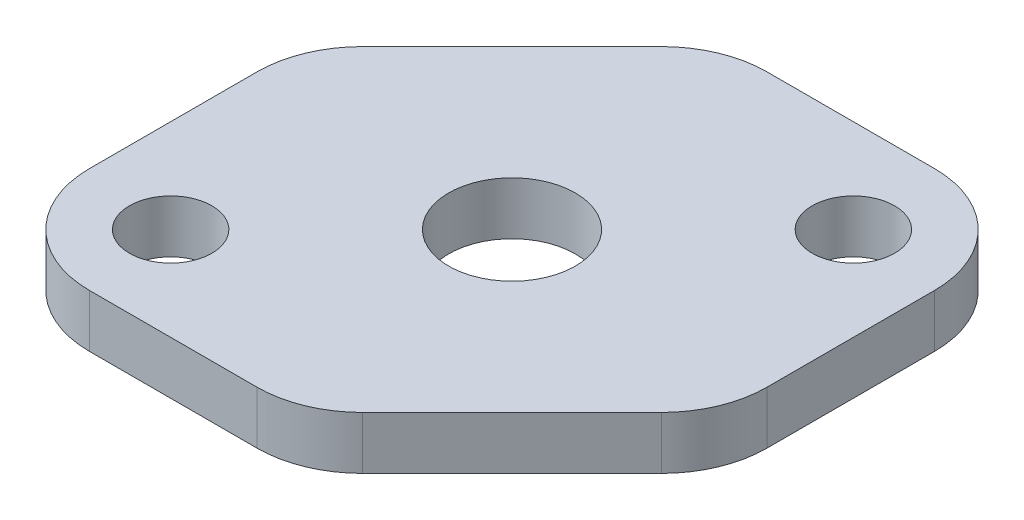
ISO-10303-21;
HEADER;
FILE_DESCRIPTION(('STEP AP214'),'2;1');
FILE_NAME('part.step','',(''),(''),'','','');
FILE_SCHEMA(('AUTOMOTIVE_DESIGN { 1 0 10303 214 1 1 1 1 }'));
ENDSEC;
DATA;
#1=APPLICATION_CONTEXT('core data for automotive mechanical design processes');
#2=APPLICATION_PROTOCOL_DEFINITION('international standard','automotive_design',2000,#1);
#3=PRODUCT_CONTEXT('',#1,'mechanical');
#4=PRODUCT('Part','Part','',(#3));
#5=PRODUCT_RELATED_PRODUCT_CATEGORY('part','',(#4));
#6=PRODUCT_DEFINITION_FORMATION('','',#4);
#7=PRODUCT_DEFINITION_CONTEXT('part definition',#1,'design');
#8=PRODUCT_DEFINITION('design','',#6,#7);
#9=PRODUCT_DEFINITION_SHAPE('','',#8);
#10=(LENGTH_UNIT() NAMED_UNIT(*) SI_UNIT(.MILLI.,.METRE.));
#11=(NAMED_UNIT(*) PLANE_ANGLE_UNIT() SI_UNIT($,.RADIAN.));
#12=(NAMED_UNIT(*) SI_UNIT($,.STERADIAN.) SOLID_ANGLE_UNIT());
#13=UNCERTAINTY_MEASURE_WITH_UNIT(LENGTH_MEASURE(1.E-05),#10,'distance_accuracy_value','');
#14=(GEOMETRIC_REPRESENTATION_CONTEXT(3) GLOBAL_UNCERTAINTY_ASSIGNED_CONTEXT((#13)) GLOBAL_UNIT_ASSIGNED_CONTEXT((#10,
#11,#12)) REPRESENTATION_CONTEXT('',''));
#15=CARTESIAN_POINT('',(0.,0.,0.));
#16=DIRECTION('',(0.,0.,1.));
#17=DIRECTION('',(1.,0.,0.));
#18=AXIS2_PLACEMENT_3D('',#15,#16,#17);
#19=CARTESIAN_POINT('',(15.875,3.175,15.875));
#20=DIRECTION('',(-1.,0.,0.));
#21=DIRECTION('',(0.,0.,1.));
#22=AXIS2_PLACEMENT_3D('',#19,#20,#21);
#23=PLANE('',#22);
#24=DIRECTION('',(0.,0.,-1.));
#25=VECTOR('',#24,1.);
#26=CARTESIAN_POINT('',(15.875,0.,15.875));
#27=LINE('',#26,#25);
#28=CARTESIAN_POINT('',(15.875,0.,0.544743878930843));
#29=VERTEX_POINT('',#28);
#30=CARTESIAN_POINT('',(15.875,0.,-9.525));
#31=VERTEX_POINT('',#30);
#32=EDGE_CURVE('E159',#29,#31,#27,.T.);
#33=ORIENTED_EDGE('',*,*,#32,.T.);
#34=DIRECTION('',(0.,-1.,0.));
#35=VECTOR('',#34,1.);
#36=CARTESIAN_POINT('',(15.875,3.175,-9.525));
#37=LINE('',#36,#35);
#38=CARTESIAN_POINT('',(15.875,3.175,-9.525));
#39=VERTEX_POINT('',#38);
#40=EDGE_CURVE('E132',#31,#39,#37,.F.);
#41=ORIENTED_EDGE('',*,*,#40,.T.);
#42=DIRECTION('',(0.,0.,-1.));
#43=VECTOR('',#42,1.);
#44=CARTESIAN_POINT('',(15.875,3.175,15.875));
#45=LINE('',#44,#43);
#46=CARTESIAN_POINT('',(15.875,3.175,0.544743878930843));
#47=VERTEX_POINT('',#46);
#48=EDGE_CURVE('E171',#47,#39,#45,.T.);
#49=ORIENTED_EDGE('',*,*,#48,.F.);
#50=DIRECTION('',(0.,1.,0.));
#51=VECTOR('',#50,1.);
#52=CARTESIAN_POINT('',(15.875,3.175,0.544743878930843));
#53=LINE('',#52,#51);
#54=EDGE_CURVE('E212',#47,#29,#53,.F.);
#55=ORIENTED_EDGE('',*,*,#54,.T.);
#56=EDGE_LOOP('',(#33,#41,#49,#55));
#57=FACE_BOUND('',#56,.T.);
#58=ADVANCED_FACE('F38',(#57),#23,.F.);
#59=CARTESIAN_POINT('',(-15.875,3.175,-15.875));
#60=DIRECTION('',(0.,0.,1.));
#61=DIRECTION('',(1.,0.,0.));
#62=AXIS2_PLACEMENT_3D('',#59,#60,#61);
#63=PLANE('',#62);
#64=DIRECTION('',(-1.,0.,0.));
#65=VECTOR('',#64,1.);
#66=CARTESIAN_POINT('',(-15.875,0.,-15.875));
#67=LINE('',#66,#65);
#68=CARTESIAN_POINT('',(9.52500000000001,0.,-15.875));
#69=VERTEX_POINT('',#68);
#70=CARTESIAN_POINT('',(-0.544743878930838,0.,-15.875));
#71=VERTEX_POINT('',#70);
#72=EDGE_CURVE('E145',#69,#71,#67,.T.);
#73=ORIENTED_EDGE('',*,*,#72,.T.);
#74=DIRECTION('',(0.,1.,0.));
#75=VECTOR('',#74,1.);
#76=CARTESIAN_POINT('',(-0.544743878930838,3.175,-15.875));
#77=LINE('',#76,#75);
#78=CARTESIAN_POINT('',(-0.544743878930838,3.175,-15.875));
#79=VERTEX_POINT('',#78);
#80=EDGE_CURVE('E150',#71,#79,#77,.T.);
#81=ORIENTED_EDGE('',*,*,#80,.T.);
#82=DIRECTION('',(-1.,0.,0.));
#83=VECTOR('',#82,1.);
#84=CARTESIAN_POINT('',(-15.875,3.175,-15.875));
#85=LINE('',#84,#83);
#86=CARTESIAN_POINT('',(9.52500000000001,3.175,-15.875));
#87=VERTEX_POINT('',#86);
#88=EDGE_CURVE('E148',#87,#79,#85,.T.);
#89=ORIENTED_EDGE('',*,*,#88,.F.);
#90=DIRECTION('',(0.,-1.,0.));
#91=VECTOR('',#90,1.);
#92=CARTESIAN_POINT('',(9.52500000000001,3.175,-15.875));
#93=LINE('',#92,#91);
#94=EDGE_CURVE('E131',#87,#69,#93,.T.);
#95=ORIENTED_EDGE('',*,*,#94,.T.);
#96=EDGE_LOOP('',(#73,#81,#89,#95));
#97=FACE_BOUND('',#96,.T.);
#98=ADVANCED_FACE('F143',(#97),#63,.F.);
#99=CARTESIAN_POINT('',(-15.875,3.175,15.875));
#100=DIRECTION('',(1.,0.,0.));
#101=DIRECTION('',(0.,0.,-1.));
#102=AXIS2_PLACEMENT_3D('',#99,#100,#101);
#103=PLANE('',#102);
#104=DIRECTION('',(0.,0.,1.));
#105=VECTOR('',#104,1.);
#106=CARTESIAN_POINT('',(-15.875,0.,15.875));
#107=LINE('',#106,#105);
#108=CARTESIAN_POINT('',(-15.875,0.,-0.544743878930849));
#109=VERTEX_POINT('',#108);
#110=CARTESIAN_POINT('',(-15.875,0.,9.525));
#111=VERTEX_POINT('',#110);
#112=EDGE_CURVE('E158',#109,#111,#107,.T.);
#113=ORIENTED_EDGE('',*,*,#112,.T.);
#114=DIRECTION('',(0.,-1.,0.));
#115=VECTOR('',#114,1.);
#116=CARTESIAN_POINT('',(-15.875,3.175,9.525));
#117=LINE('',#116,#115);
#118=CARTESIAN_POINT('',(-15.875,3.175,9.525));
#119=VERTEX_POINT('',#118);
#120=EDGE_CURVE('E11',#111,#119,#117,.F.);
#121=ORIENTED_EDGE('',*,*,#120,.T.);
#122=DIRECTION('',(0.,0.,1.));
#123=VECTOR('',#122,1.);
#124=CARTESIAN_POINT('',(-15.875,3.175,15.875));
#125=LINE('',#124,#123);
#126=CARTESIAN_POINT('',(-15.875,3.175,-0.544743878930849));
#127=VERTEX_POINT('',#126);
#128=EDGE_CURVE('E235',#127,#119,#125,.T.);
#129=ORIENTED_EDGE('',*,*,#128,.F.);
#130=DIRECTION('',(0.,1.,0.));
#131=VECTOR('',#130,1.);
#132=CARTESIAN_POINT('',(-15.875,3.175,-0.544743878930849));
#133=LINE('',#132,#131);
#134=EDGE_CURVE('E47',#127,#109,#133,.F.);
#135=ORIENTED_EDGE('',*,*,#134,.T.);
#136=EDGE_LOOP('',(#113,#121,#129,#135));
#137=FACE_BOUND('',#136,.T.);
#138=ADVANCED_FACE('F295',(#137),#103,.F.);
#139=CARTESIAN_POINT('',(-15.875,3.175,15.875));
#140=DIRECTION('',(0.,0.,-1.));
#141=DIRECTION('',(-1.,0.,0.));
#142=AXIS2_PLACEMENT_3D('',#139,#140,#141);
#143=PLANE('',#142);
#144=DIRECTION('',(1.,0.,0.));
#145=VECTOR('',#144,1.);
#146=CARTESIAN_POINT('',(-15.875,0.,15.875));
#147=LINE('',#146,#145);
#148=CARTESIAN_POINT('',(-9.52499999999999,0.,15.875));
#149=VERTEX_POINT('',#148);
#150=CARTESIAN_POINT('',(0.544743878930856,0.,15.875));
#151=VERTEX_POINT('',#150);
#152=EDGE_CURVE('E163',#149,#151,#147,.T.);
#153=ORIENTED_EDGE('',*,*,#152,.T.);
#154=DIRECTION('',(0.,1.,0.));
#155=VECTOR('',#154,1.);
#156=CARTESIAN_POINT('',(0.544743878930856,3.175,15.875));
#157=LINE('',#156,#155);
#158=CARTESIAN_POINT('',(0.544743878930856,3.175,15.875));
#159=VERTEX_POINT('',#158);
#160=EDGE_CURVE('E228',#151,#159,#157,.T.);
#161=ORIENTED_EDGE('',*,*,#160,.T.);
#162=DIRECTION('',(1.,0.,0.));
#163=VECTOR('',#162,1.);
#164=CARTESIAN_POINT('',(-15.875,3.175,15.875));
#165=LINE('',#164,#163);
#166=CARTESIAN_POINT('',(-9.52499999999999,3.175,15.875));
#167=VERTEX_POINT('',#166);
#168=EDGE_CURVE('E151',#167,#159,#165,.T.);
#169=ORIENTED_EDGE('',*,*,#168,.F.);
#170=DIRECTION('',(0.,-1.,0.));
#171=VECTOR('',#170,1.);
#172=CARTESIAN_POINT('',(-9.52499999999999,3.175,15.875));
#173=LINE('',#172,#171);
#174=EDGE_CURVE('E224',#167,#149,#173,.T.);
#175=ORIENTED_EDGE('',*,*,#174,.T.);
#176=EDGE_LOOP('',(#153,#161,#169,#175));
#177=FACE_BOUND('',#176,.T.);
#178=ADVANCED_FACE('F302',(#177),#143,.F.);
#179=CARTESIAN_POINT('',(0.,3.175,0.));
#180=DIRECTION('',(0.,-1.,0.));
#181=DIRECTION('',(0.,0.,-1.));
#182=AXIS2_PLACEMENT_3D('',#179,#180,#181);
#183=PLANE('',#182);
#184=CARTESIAN_POINT('',(0.,3.175,0.));
#185=DIRECTION('',(0.,-1.,0.));
#186=DIRECTION('',(0.,0.,-1.));
#187=AXIS2_PLACEMENT_3D('',#184,#185,#186);
#188=CIRCLE('',#187,3.81);
#189=CARTESIAN_POINT('',(0.,3.175,-3.81));
#190=VERTEX_POINT('',#189);
#191=EDGE_CURVE('E251',#190,#190,#188,.T.);
#192=ORIENTED_EDGE('',*,*,#191,.T.);
#193=EDGE_LOOP('',(#192));
#194=FACE_BOUND('',#193,.T.);
#195=CARTESIAN_POINT('',(-10.2623399243318,3.175,10.2623399243318));
#196=DIRECTION('',(0.,-1.,0.));
#197=DIRECTION('',(0.,0.,-1.));
#198=AXIS2_PLACEMENT_3D('',#195,#196,#197);
#199=CIRCLE('',#198,2.4765);
#200=CARTESIAN_POINT('',(-10.2623399243318,3.175,7.78583992433178));
#201=VERTEX_POINT('',#200);
#202=EDGE_CURVE('E165',#201,#201,#199,.T.);
#203=ORIENTED_EDGE('',*,*,#202,.T.);
#204=EDGE_LOOP('',(#203));
#205=FACE_BOUND('',#204,.T.);
#206=CARTESIAN_POINT('',(10.2623399243318,3.175,-10.2623399243318));
#207=DIRECTION('',(0.,-1.,0.));
#208=DIRECTION('',(0.,0.,-1.));
#209=AXIS2_PLACEMENT_3D('',#206,#207,#208);
#210=CIRCLE('',#209,2.4765);
#211=CARTESIAN_POINT('',(10.2623399243318,3.175,-12.7388399243318));
#212=VERTEX_POINT('',#211);
#213=EDGE_CURVE('E250',#212,#212,#210,.T.);
#214=ORIENTED_EDGE('',*,*,#213,.T.);
#215=EDGE_LOOP('',(#214));
#216=FACE_BOUND('',#215,.T.);
#217=ORIENTED_EDGE('',*,*,#88,.T.);
#218=CARTESIAN_POINT('',(-0.544743878930838,3.175,-9.525));
#219=DIRECTION('',(0.,-1.,0.));
#220=DIRECTION('',(0.,0.,-1.));
#221=AXIS2_PLACEMENT_3D('',#218,#219,#220);
#222=CIRCLE('',#221,6.35);
#223=CARTESIAN_POINT('',(-5.03487193946541,3.175,-14.0151280605346));
#224=VERTEX_POINT('',#223);
#225=EDGE_CURVE('E190',#79,#224,#222,.F.);
#226=ORIENTED_EDGE('',*,*,#225,.T.);
#227=DIRECTION('',(0.707106781186547,0.,-0.707106781186547));
#228=VECTOR('',#227,1.);
#229=CARTESIAN_POINT('',(-3.17499999999999,3.175,-15.875));
#230=LINE('',#229,#228);
#231=CARTESIAN_POINT('',(-14.0151280605346,3.175,-5.03487193946543));
#232=VERTEX_POINT('',#231);
#233=EDGE_CURVE('E278',#232,#224,#230,.T.);
#234=ORIENTED_EDGE('',*,*,#233,.F.);
#235=CARTESIAN_POINT('',(-9.52499999999999,3.175,-0.54474387893085));
#236=DIRECTION('',(0.,-1.,0.));
#237=DIRECTION('',(0.,0.,-1.));
#238=AXIS2_PLACEMENT_3D('',#235,#236,#237);
#239=CIRCLE('',#238,6.35);
#240=EDGE_CURVE('E175',#232,#127,#239,.F.);
#241=ORIENTED_EDGE('',*,*,#240,.T.);
#242=ORIENTED_EDGE('',*,*,#128,.T.);
#243=CARTESIAN_POINT('',(-9.52499999999999,3.175,9.525));
#244=DIRECTION('',(0.,-1.,0.));
#245=DIRECTION('',(0.,0.,-1.));
#246=AXIS2_PLACEMENT_3D('',#243,#244,#245);
#247=CIRCLE('',#246,6.35);
#248=EDGE_CURVE('E178',#119,#167,#247,.F.);
#249=ORIENTED_EDGE('',*,*,#248,.T.);
#250=ORIENTED_EDGE('',*,*,#168,.T.);
#251=CARTESIAN_POINT('',(0.544743878930856,3.175,9.525));
#252=DIRECTION('',(0.,-1.,0.));
#253=DIRECTION('',(0.,0.,-1.));
#254=AXIS2_PLACEMENT_3D('',#251,#252,#253);
#255=CIRCLE('',#254,6.35);
#256=CARTESIAN_POINT('',(5.03487193946543,3.175,14.0151280605346));
#257=VERTEX_POINT('',#256);
#258=EDGE_CURVE('E181',#159,#257,#255,.F.);
#259=ORIENTED_EDGE('',*,*,#258,.T.);
#260=DIRECTION('',(-0.707106781186547,0.,0.707106781186547));
#261=VECTOR('',#260,1.);
#262=CARTESIAN_POINT('',(15.875,3.175,3.175));
#263=LINE('',#262,#261);
#264=CARTESIAN_POINT('',(14.0151280605346,3.175,5.03487193946542));
#265=VERTEX_POINT('',#264);
#266=EDGE_CURVE('E270',#265,#257,#263,.T.);
#267=ORIENTED_EDGE('',*,*,#266,.F.);
#268=CARTESIAN_POINT('',(9.52500000000001,3.175,0.544743878930843));
#269=DIRECTION('',(0.,-1.,0.));
#270=DIRECTION('',(0.,0.,-1.));
#271=AXIS2_PLACEMENT_3D('',#268,#269,#270);
#272=CIRCLE('',#271,6.35);
#273=EDGE_CURVE('E184',#265,#47,#272,.F.);
#274=ORIENTED_EDGE('',*,*,#273,.T.);
#275=ORIENTED_EDGE('',*,*,#48,.T.);
#276=CARTESIAN_POINT('',(9.52500000000001,3.175,-9.525));
#277=DIRECTION('',(0.,-1.,0.));
#278=DIRECTION('',(0.,0.,-1.));
#279=AXIS2_PLACEMENT_3D('',#276,#277,#278);
#280=CIRCLE('',#279,6.35);
#281=EDGE_CURVE('E187',#39,#87,#280,.F.);
#282=ORIENTED_EDGE('',*,*,#281,.T.);
#283=EDGE_LOOP('',(#217,#226,#234,#241,#242,#249,#250,#259,#267,#274,#275,#282));
#284=FACE_BOUND('',#283,.T.);
#285=ADVANCED_FACE('F290',(#194,#205,#216,#284),#183,.F.);
#286=CARTESIAN_POINT('',(0.,0.,0.));
#287=DIRECTION('',(0.,-1.,0.));
#288=DIRECTION('',(0.,0.,-1.));
#289=AXIS2_PLACEMENT_3D('',#286,#287,#288);
#290=PLANE('',#289);
#291=DIRECTION('',(0.707106781186547,0.,-0.707106781186547));
#292=VECTOR('',#291,1.);
#293=CARTESIAN_POINT('',(-3.17499999999999,0.,-15.875));
#294=LINE('',#293,#292);
#295=CARTESIAN_POINT('',(-14.0151280605346,0.,-5.03487193946543));
#296=VERTEX_POINT('',#295);
#297=CARTESIAN_POINT('',(-5.03487193946541,0.,-14.0151280605346));
#298=VERTEX_POINT('',#297);
#299=EDGE_CURVE('E266',#296,#298,#294,.T.);
#300=ORIENTED_EDGE('',*,*,#299,.T.);
#301=CARTESIAN_POINT('',(-0.544743878930838,0.,-9.525));
#302=DIRECTION('',(0.,-1.,0.));
#303=DIRECTION('',(0.,0.,-1.));
#304=AXIS2_PLACEMENT_3D('',#301,#302,#303);
#305=CIRCLE('',#304,6.35);
#306=EDGE_CURVE('E137',#298,#71,#305,.T.);
#307=ORIENTED_EDGE('',*,*,#306,.T.);
#308=ORIENTED_EDGE('',*,*,#72,.F.);
#309=CARTESIAN_POINT('',(9.52500000000001,0.,-9.525));
#310=DIRECTION('',(0.,-1.,0.));
#311=DIRECTION('',(0.,0.,-1.));
#312=AXIS2_PLACEMENT_3D('',#309,#310,#311);
#313=CIRCLE('',#312,6.35);
#314=EDGE_CURVE('E127',#69,#31,#313,.T.);
#315=ORIENTED_EDGE('',*,*,#314,.T.);
#316=ORIENTED_EDGE('',*,*,#32,.F.);
#317=CARTESIAN_POINT('',(9.52500000000001,0.,0.544743878930843));
#318=DIRECTION('',(0.,-1.,0.));
#319=DIRECTION('',(0.,0.,-1.));
#320=AXIS2_PLACEMENT_3D('',#317,#318,#319);
#321=CIRCLE('',#320,6.35);
#322=CARTESIAN_POINT('',(14.0151280605346,0.,5.03487193946542));
#323=VERTEX_POINT('',#322);
#324=EDGE_CURVE('E138',#29,#323,#321,.T.);
#325=ORIENTED_EDGE('',*,*,#324,.T.);
#326=DIRECTION('',(-0.707106781186547,0.,0.707106781186547));
#327=VECTOR('',#326,1.);
#328=CARTESIAN_POINT('',(15.875,0.,3.175));
#329=LINE('',#328,#327);
#330=CARTESIAN_POINT('',(5.03487193946543,0.,14.0151280605346));
#331=VERTEX_POINT('',#330);
#332=EDGE_CURVE('E274',#323,#331,#329,.T.);
#333=ORIENTED_EDGE('',*,*,#332,.T.);
#334=CARTESIAN_POINT('',(0.544743878930856,0.,9.525));
#335=DIRECTION('',(0.,-1.,0.));
#336=DIRECTION('',(0.,0.,-1.));
#337=AXIS2_PLACEMENT_3D('',#334,#335,#336);
#338=CIRCLE('',#337,6.35);
#339=EDGE_CURVE('E205',#331,#151,#338,.T.);
#340=ORIENTED_EDGE('',*,*,#339,.T.);
#341=ORIENTED_EDGE('',*,*,#152,.F.);
#342=CARTESIAN_POINT('',(-9.52499999999999,0.,9.525));
#343=DIRECTION('',(0.,-1.,0.));
#344=DIRECTION('',(0.,0.,-1.));
#345=AXIS2_PLACEMENT_3D('',#342,#343,#344);
#346=CIRCLE('',#345,6.35);
#347=EDGE_CURVE('E54',#149,#111,#346,.T.);
#348=ORIENTED_EDGE('',*,*,#347,.T.);
#349=ORIENTED_EDGE('',*,*,#112,.F.);
#350=CARTESIAN_POINT('',(-9.52499999999999,0.,-0.54474387893085));
#351=DIRECTION('',(0.,-1.,0.));
#352=DIRECTION('',(0.,0.,-1.));
#353=AXIS2_PLACEMENT_3D('',#350,#351,#352);
#354=CIRCLE('',#353,6.35);
#355=EDGE_CURVE('E200',#109,#296,#354,.T.);
#356=ORIENTED_EDGE('',*,*,#355,.T.);
#357=EDGE_LOOP('',(#300,#307,#308,#315,#316,#325,#333,#340,#341,#348,#349,#356));
#358=FACE_BOUND('',#357,.T.);
#359=CARTESIAN_POINT('',(0.,0.,0.));
#360=DIRECTION('',(0.,-1.,0.));
#361=DIRECTION('',(0.,0.,-1.));
#362=AXIS2_PLACEMENT_3D('',#359,#360,#361);
#363=CIRCLE('',#362,3.81);
#364=CARTESIAN_POINT('',(0.,0.,-3.81));
#365=VERTEX_POINT('',#364);
#366=EDGE_CURVE('E262',#365,#365,#363,.T.);
#367=ORIENTED_EDGE('',*,*,#366,.F.);
#368=EDGE_LOOP('',(#367));
#369=FACE_BOUND('',#368,.T.);
#370=CARTESIAN_POINT('',(-10.2623399243318,0.,10.2623399243318));
#371=DIRECTION('',(0.,-1.,0.));
#372=DIRECTION('',(0.,0.,-1.));
#373=AXIS2_PLACEMENT_3D('',#370,#371,#372);
#374=CIRCLE('',#373,2.4765);
#375=CARTESIAN_POINT('',(-10.2623399243318,0.,7.78583992433178));
#376=VERTEX_POINT('',#375);
#377=EDGE_CURVE('E255',#376,#376,#374,.T.);
#378=ORIENTED_EDGE('',*,*,#377,.F.);
#379=EDGE_LOOP('',(#378));
#380=FACE_BOUND('',#379,.T.);
#381=CARTESIAN_POINT('',(10.2623399243318,0.,-10.2623399243318));
#382=DIRECTION('',(0.,-1.,0.));
#383=DIRECTION('',(0.,0.,-1.));
#384=AXIS2_PLACEMENT_3D('',#381,#382,#383);
#385=CIRCLE('',#384,2.4765);
#386=CARTESIAN_POINT('',(10.2623399243318,0.,-12.7388399243318));
#387=VERTEX_POINT('',#386);
#388=EDGE_CURVE('E246',#387,#387,#385,.T.);
#389=ORIENTED_EDGE('',*,*,#388,.F.);
#390=EDGE_LOOP('',(#389));
#391=FACE_BOUND('',#390,.T.);
#392=ADVANCED_FACE('F154',(#358,#369,#380,#391),#290,.T.);
#393=CARTESIAN_POINT('',(10.2623399243318,3.175,-10.2623399243318));
#394=DIRECTION('',(0.,-1.,0.));
#395=DIRECTION('',(0.,0.,-1.));
#396=AXIS2_PLACEMENT_3D('',#393,#394,#395);
#397=CYLINDRICAL_SURFACE('',#396,2.4765);
#398=ORIENTED_EDGE('',*,*,#213,.F.);
#399=EDGE_LOOP('',(#398));
#400=FACE_BOUND('',#399,.T.);
#401=ORIENTED_EDGE('',*,*,#388,.T.);
#402=EDGE_LOOP('',(#401));
#403=FACE_BOUND('',#402,.T.);
#404=ADVANCED_FACE('F395',(#400,#403),#397,.F.);
#405=CARTESIAN_POINT('',(-10.2623399243318,3.175,10.2623399243318));
#406=DIRECTION('',(0.,-1.,0.));
#407=DIRECTION('',(0.,0.,-1.));
#408=AXIS2_PLACEMENT_3D('',#405,#406,#407);
#409=CYLINDRICAL_SURFACE('',#408,2.4765);
#410=ORIENTED_EDGE('',*,*,#202,.F.);
#411=EDGE_LOOP('',(#410));
#412=FACE_BOUND('',#411,.T.);
#413=ORIENTED_EDGE('',*,*,#377,.T.);
#414=EDGE_LOOP('',(#413));
#415=FACE_BOUND('',#414,.T.);
#416=ADVANCED_FACE('F440',(#412,#415),#409,.F.);
#417=CARTESIAN_POINT('',(0.,3.175,0.));
#418=DIRECTION('',(0.,-1.,0.));
#419=DIRECTION('',(0.,0.,-1.));
#420=AXIS2_PLACEMENT_3D('',#417,#418,#419);
#421=CYLINDRICAL_SURFACE('',#420,3.81);
#422=ORIENTED_EDGE('',*,*,#191,.F.);
#423=EDGE_LOOP('',(#422));
#424=FACE_BOUND('',#423,.T.);
#425=ORIENTED_EDGE('',*,*,#366,.T.);
#426=EDGE_LOOP('',(#425));
#427=FACE_BOUND('',#426,.T.);
#428=ADVANCED_FACE('F385',(#424,#427),#421,.F.);
#429=CARTESIAN_POINT('',(15.875,0.,3.175));
#430=DIRECTION('',(-0.707106781186548,0.,-0.707106781186548));
#431=DIRECTION('',(-0.707106781186548,0.,0.707106781186548));
#432=AXIS2_PLACEMENT_3D('',#429,#430,#431);
#433=PLANE('',#432);
#434=ORIENTED_EDGE('',*,*,#332,.F.);
#435=DIRECTION('',(0.,1.,0.));
#436=VECTOR('',#435,1.);
#437=CARTESIAN_POINT('',(14.0151280605346,0.,5.03487193946542));
#438=LINE('',#437,#436);
#439=EDGE_CURVE('E220',#323,#265,#438,.T.);
#440=ORIENTED_EDGE('',*,*,#439,.T.);
#441=ORIENTED_EDGE('',*,*,#266,.T.);
#442=DIRECTION('',(0.,1.,0.));
#443=VECTOR('',#442,1.);
#444=CARTESIAN_POINT('',(5.03487193946543,0.,14.0151280605346));
#445=LINE('',#444,#443);
#446=EDGE_CURVE('E217',#257,#331,#445,.F.);
#447=ORIENTED_EDGE('',*,*,#446,.T.);
#448=EDGE_LOOP('',(#434,#440,#441,#447));
#449=FACE_BOUND('',#448,.T.);
#450=ADVANCED_FACE('F311',(#449),#433,.F.);
#451=CARTESIAN_POINT('',(-3.17499999999999,0.,-15.875));
#452=DIRECTION('',(0.707106781186548,0.,0.707106781186548));
#453=DIRECTION('',(0.707106781186548,0.,-0.707106781186548));
#454=AXIS2_PLACEMENT_3D('',#451,#452,#453);
#455=PLANE('',#454);
#456=ORIENTED_EDGE('',*,*,#233,.T.);
#457=DIRECTION('',(0.,1.,0.));
#458=VECTOR('',#457,1.);
#459=CARTESIAN_POINT('',(-5.03487193946541,0.,-14.0151280605346));
#460=LINE('',#459,#458);
#461=EDGE_CURVE('E197',#224,#298,#460,.F.);
#462=ORIENTED_EDGE('',*,*,#461,.T.);
#463=ORIENTED_EDGE('',*,*,#299,.F.);
#464=DIRECTION('',(0.,1.,0.));
#465=VECTOR('',#464,1.);
#466=CARTESIAN_POINT('',(-14.0151280605346,0.,-5.03487193946543));
#467=LINE('',#466,#465);
#468=EDGE_CURVE('E193',#296,#232,#467,.T.);
#469=ORIENTED_EDGE('',*,*,#468,.T.);
#470=EDGE_LOOP('',(#456,#462,#463,#469));
#471=FACE_BOUND('',#470,.T.);
#472=ADVANCED_FACE('F292',(#471),#455,.F.);
#473=CARTESIAN_POINT('',(-0.544743878930838,3.175,-9.525));
#474=DIRECTION('',(0.,1.,0.));
#475=DIRECTION('',(0.,0.,1.));
#476=AXIS2_PLACEMENT_3D('',#473,#474,#475);
#477=CYLINDRICAL_SURFACE('',#476,6.35);
#478=ORIENTED_EDGE('',*,*,#306,.F.);
#479=ORIENTED_EDGE('',*,*,#461,.F.);
#480=ORIENTED_EDGE('',*,*,#225,.F.);
#481=ORIENTED_EDGE('',*,*,#80,.F.);
#482=EDGE_LOOP('',(#478,#479,#480,#481));
#483=FACE_BOUND('',#482,.T.);
#484=ADVANCED_FACE('F289',(#483),#477,.T.);
#485=CARTESIAN_POINT('',(9.52500000000001,3.175,-9.525));
#486=DIRECTION('',(0.,-1.,0.));
#487=DIRECTION('',(0.,0.,-1.));
#488=AXIS2_PLACEMENT_3D('',#485,#486,#487);
#489=CYLINDRICAL_SURFACE('',#488,6.35);
#490=ORIENTED_EDGE('',*,*,#281,.F.);
#491=ORIENTED_EDGE('',*,*,#40,.F.);
#492=ORIENTED_EDGE('',*,*,#314,.F.);
#493=ORIENTED_EDGE('',*,*,#94,.F.);
#494=EDGE_LOOP('',(#490,#491,#492,#493));
#495=FACE_BOUND('',#494,.T.);
#496=ADVANCED_FACE('F130',(#495),#489,.T.);
#497=CARTESIAN_POINT('',(9.52500000000001,0.,0.544743878930843));
#498=DIRECTION('',(0.,1.,0.));
#499=DIRECTION('',(0.,0.,1.));
#500=AXIS2_PLACEMENT_3D('',#497,#498,#499);
#501=CYLINDRICAL_SURFACE('',#500,6.35);
#502=ORIENTED_EDGE('',*,*,#324,.F.);
#503=ORIENTED_EDGE('',*,*,#54,.F.);
#504=ORIENTED_EDGE('',*,*,#273,.F.);
#505=ORIENTED_EDGE('',*,*,#439,.F.);
#506=EDGE_LOOP('',(#502,#503,#504,#505));
#507=FACE_BOUND('',#506,.T.);
#508=ADVANCED_FACE('F315',(#507),#501,.T.);
#509=CARTESIAN_POINT('',(0.544743878930856,3.175,9.525));
#510=DIRECTION('',(0.,1.,0.));
#511=DIRECTION('',(0.,0.,1.));
#512=AXIS2_PLACEMENT_3D('',#509,#510,#511);
#513=CYLINDRICAL_SURFACE('',#512,6.35);
#514=ORIENTED_EDGE('',*,*,#339,.F.);
#515=ORIENTED_EDGE('',*,*,#446,.F.);
#516=ORIENTED_EDGE('',*,*,#258,.F.);
#517=ORIENTED_EDGE('',*,*,#160,.F.);
#518=EDGE_LOOP('',(#514,#515,#516,#517));
#519=FACE_BOUND('',#518,.T.);
#520=ADVANCED_FACE('F306',(#519),#513,.T.);
#521=CARTESIAN_POINT('',(-9.52499999999999,3.175,9.525));
#522=DIRECTION('',(0.,-1.,0.));
#523=DIRECTION('',(0.,0.,-1.));
#524=AXIS2_PLACEMENT_3D('',#521,#522,#523);
#525=CYLINDRICAL_SURFACE('',#524,6.35);
#526=ORIENTED_EDGE('',*,*,#248,.F.);
#527=ORIENTED_EDGE('',*,*,#120,.F.);
#528=ORIENTED_EDGE('',*,*,#347,.F.);
#529=ORIENTED_EDGE('',*,*,#174,.F.);
#530=EDGE_LOOP('',(#526,#527,#528,#529));
#531=FACE_BOUND('',#530,.T.);
#532=ADVANCED_FACE('F298',(#531),#525,.T.);
#533=CARTESIAN_POINT('',(-9.52499999999999,0.,-0.54474387893085));
#534=DIRECTION('',(0.,1.,0.));
#535=DIRECTION('',(0.,0.,1.));
#536=AXIS2_PLACEMENT_3D('',#533,#534,#535);
#537=CYLINDRICAL_SURFACE('',#536,6.35);
#538=ORIENTED_EDGE('',*,*,#355,.F.);
#539=ORIENTED_EDGE('',*,*,#134,.F.);
#540=ORIENTED_EDGE('',*,*,#240,.F.);
#541=ORIENTED_EDGE('',*,*,#468,.F.);
#542=EDGE_LOOP('',(#538,#539,#540,#541));
#543=FACE_BOUND('',#542,.T.);
#544=ADVANCED_FACE('F40',(#543),#537,.T.);
#545=CLOSED_SHELL('',(#58,#98,#138,#178,#285,#392,#404,#416,#428,#450,#472,#484,#496,#508,#520,
#532,#544));
#546=MANIFOLD_SOLID_BREP('B2',#545);
#547=ADVANCED_BREP_SHAPE_REPRESENTATION('',(#18,#546),#14);
#548=SHAPE_DEFINITION_REPRESENTATION(#9,#547);
ENDSEC;
END-ISO-10303-21;
